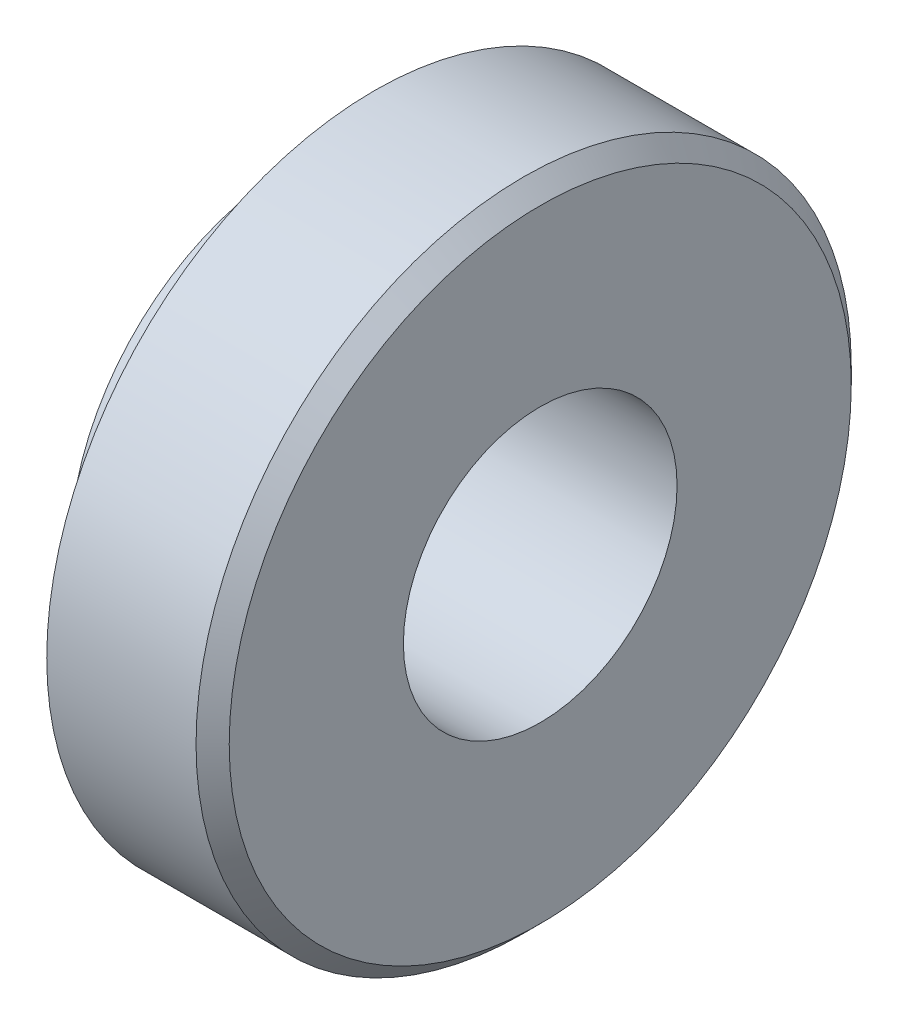
ISO-10303-21;
HEADER;
FILE_DESCRIPTION(('STEP AP214'),'2;1');
FILE_NAME('part.step','',(''),(''),'','','');
FILE_SCHEMA(('AUTOMOTIVE_DESIGN { 1 0 10303 214 1 1 1 1 }'));
ENDSEC;
DATA;
#1=APPLICATION_CONTEXT('core data for automotive mechanical design processes');
#2=APPLICATION_PROTOCOL_DEFINITION('international standard','automotive_design',2000,#1);
#3=PRODUCT_CONTEXT('',#1,'mechanical');
#4=PRODUCT('Part','Part','',(#3));
#5=PRODUCT_RELATED_PRODUCT_CATEGORY('part','',(#4));
#6=PRODUCT_DEFINITION_FORMATION('','',#4);
#7=PRODUCT_DEFINITION_CONTEXT('part definition',#1,'design');
#8=PRODUCT_DEFINITION('design','',#6,#7);
#9=PRODUCT_DEFINITION_SHAPE('','',#8);
#10=(LENGTH_UNIT() NAMED_UNIT(*) SI_UNIT(.MILLI.,.METRE.));
#11=(NAMED_UNIT(*) PLANE_ANGLE_UNIT() SI_UNIT($,.RADIAN.));
#12=(NAMED_UNIT(*) SI_UNIT($,.STERADIAN.) SOLID_ANGLE_UNIT());
#13=UNCERTAINTY_MEASURE_WITH_UNIT(LENGTH_MEASURE(1.E-05),#10,'distance_accuracy_value','');
#14=(GEOMETRIC_REPRESENTATION_CONTEXT(3) GLOBAL_UNCERTAINTY_ASSIGNED_CONTEXT((#13)) GLOBAL_UNIT_ASSIGNED_CONTEXT((#10,
#11,#12)) REPRESENTATION_CONTEXT('',''));
#15=CARTESIAN_POINT('',(0.,0.,0.));
#16=DIRECTION('',(0.,0.,1.));
#17=DIRECTION('',(1.,0.,0.));
#18=AXIS2_PLACEMENT_3D('',#15,#16,#17);
#19=CARTESIAN_POINT('',(0.,3.95,0.));
#20=DIRECTION('',(-1.,0.,0.));
#21=DIRECTION('',(0.,0.,1.));
#22=AXIS2_PLACEMENT_3D('',#19,#20,#21);
#23=PLANE('',#22);
#24=CARTESIAN_POINT('',(0.,0.,0.));
#25=DIRECTION('',(-1.,0.,0.));
#26=DIRECTION('',(0.,0.,1.));
#27=AXIS2_PLACEMENT_3D('',#24,#25,#26);
#28=CIRCLE('',#27,3.75);
#29=CARTESIAN_POINT('',(0.,0.,3.75));
#30=VERTEX_POINT('',#29);
#31=EDGE_CURVE('E10',#30,#30,#28,.F.);
#32=ORIENTED_EDGE('',*,*,#31,.T.);
#33=EDGE_LOOP('',(#32));
#34=FACE_BOUND('',#33,.T.);
#35=CARTESIAN_POINT('',(0.,0.,0.));
#36=DIRECTION('',(-1.,0.,0.));
#37=DIRECTION('',(0.,0.,1.));
#38=AXIS2_PLACEMENT_3D('',#35,#36,#37);
#39=CIRCLE('',#38,1.65);
#40=CARTESIAN_POINT('',(0.,0.,1.65));
#41=VERTEX_POINT('',#40);
#42=EDGE_CURVE('E47',#41,#41,#39,.T.);
#43=ORIENTED_EDGE('',*,*,#42,.T.);
#44=EDGE_LOOP('',(#43));
#45=FACE_BOUND('',#44,.T.);
#46=ADVANCED_FACE('F25',(#34,#45),#23,.F.);
#47=CARTESIAN_POINT('',(0.,0.,0.));
#48=DIRECTION('',(-1.,0.,0.));
#49=DIRECTION('',(0.,0.,1.));
#50=AXIS2_PLACEMENT_3D('',#47,#48,#49);
#51=CYLINDRICAL_SURFACE('',#50,3.95);
#52=CARTESIAN_POINT('',(-0.199999999999998,0.,0.));
#53=DIRECTION('',(-1.,0.,0.));
#54=DIRECTION('',(0.,0.,1.));
#55=AXIS2_PLACEMENT_3D('',#52,#53,#54);
#56=CIRCLE('',#55,3.95);
#57=CARTESIAN_POINT('',(-0.199999999999998,0.,3.95));
#58=VERTEX_POINT('',#57);
#59=EDGE_CURVE('E31',#58,#58,#56,.T.);
#60=ORIENTED_EDGE('',*,*,#59,.T.);
#61=EDGE_LOOP('',(#60));
#62=FACE_BOUND('',#61,.T.);
#63=CARTESIAN_POINT('',(-2.,0.,0.));
#64=DIRECTION('',(-1.,0.,0.));
#65=DIRECTION('',(0.,0.,1.));
#66=AXIS2_PLACEMENT_3D('',#63,#64,#65);
#67=CIRCLE('',#66,3.95);
#68=CARTESIAN_POINT('',(-2.,0.,3.95));
#69=VERTEX_POINT('',#68);
#70=EDGE_CURVE('E35',#69,#69,#67,.T.);
#71=ORIENTED_EDGE('',*,*,#70,.F.);
#72=EDGE_LOOP('',(#71));
#73=FACE_BOUND('',#72,.T.);
#74=ADVANCED_FACE('F71',(#62,#73),#51,.T.);
#75=CARTESIAN_POINT('',(-2.,2.69,0.));
#76=DIRECTION('',(1.,0.,0.));
#77=DIRECTION('',(0.,0.,-1.));
#78=AXIS2_PLACEMENT_3D('',#75,#76,#77);
#79=PLANE('',#78);
#80=CARTESIAN_POINT('',(-2.,0.,0.));
#81=DIRECTION('',(-1.,0.,0.));
#82=DIRECTION('',(0.,0.,1.));
#83=AXIS2_PLACEMENT_3D('',#80,#81,#82);
#84=CIRCLE('',#83,2.69);
#85=CARTESIAN_POINT('',(-2.,0.,2.69));
#86=VERTEX_POINT('',#85);
#87=EDGE_CURVE('E39',#86,#86,#84,.T.);
#88=ORIENTED_EDGE('',*,*,#87,.F.);
#89=EDGE_LOOP('',(#88));
#90=FACE_BOUND('',#89,.T.);
#91=ORIENTED_EDGE('',*,*,#70,.T.);
#92=EDGE_LOOP('',(#91));
#93=FACE_BOUND('',#92,.T.);
#94=ADVANCED_FACE('F65',(#90,#93),#79,.F.);
#95=CARTESIAN_POINT('',(0.,0.,0.));
#96=DIRECTION('',(-1.,0.,0.));
#97=DIRECTION('',(0.,0.,1.));
#98=AXIS2_PLACEMENT_3D('',#95,#96,#97);
#99=CYLINDRICAL_SURFACE('',#98,2.69);
#100=CARTESIAN_POINT('',(-2.98,0.,0.));
#101=DIRECTION('',(-1.,0.,0.));
#102=DIRECTION('',(0.,0.,1.));
#103=AXIS2_PLACEMENT_3D('',#100,#101,#102);
#104=CIRCLE('',#103,2.69);
#105=CARTESIAN_POINT('',(-2.98,0.,2.69));
#106=VERTEX_POINT('',#105);
#107=EDGE_CURVE('E44',#106,#106,#104,.T.);
#108=ORIENTED_EDGE('',*,*,#107,.F.);
#109=EDGE_LOOP('',(#108));
#110=FACE_BOUND('',#109,.T.);
#111=ORIENTED_EDGE('',*,*,#87,.T.);
#112=EDGE_LOOP('',(#111));
#113=FACE_BOUND('',#112,.T.);
#114=ADVANCED_FACE('F59',(#110,#113),#99,.T.);
#115=CARTESIAN_POINT('',(-2.98,0.,0.));
#116=DIRECTION('',(1.,0.,0.));
#117=DIRECTION('',(0.,0.,-1.));
#118=AXIS2_PLACEMENT_3D('',#115,#116,#117);
#119=PLANE('',#118);
#120=CARTESIAN_POINT('',(-2.98,0.,0.));
#121=DIRECTION('',(-1.,0.,0.));
#122=DIRECTION('',(0.,0.,1.));
#123=AXIS2_PLACEMENT_3D('',#120,#121,#122);
#124=CIRCLE('',#123,1.64999999999999);
#125=CARTESIAN_POINT('',(-2.98,0.,1.64999999999999));
#126=VERTEX_POINT('',#125);
#127=EDGE_CURVE('E50',#126,#126,#124,.T.);
#128=ORIENTED_EDGE('',*,*,#127,.F.);
#129=EDGE_LOOP('',(#128));
#130=FACE_BOUND('',#129,.T.);
#131=ORIENTED_EDGE('',*,*,#107,.T.);
#132=EDGE_LOOP('',(#131));
#133=FACE_BOUND('',#132,.T.);
#134=ADVANCED_FACE('F56',(#130,#133),#119,.F.);
#135=CARTESIAN_POINT('',(-2.98,0.,0.));
#136=DIRECTION('',(-1.,0.,0.));
#137=DIRECTION('',(0.,0.,1.));
#138=AXIS2_PLACEMENT_3D('',#135,#136,#137);
#139=CYLINDRICAL_SURFACE('',#138,1.64999999999999);
#140=ORIENTED_EDGE('',*,*,#42,.F.);
#141=EDGE_LOOP('',(#140));
#142=FACE_BOUND('',#141,.T.);
#143=ORIENTED_EDGE('',*,*,#127,.T.);
#144=EDGE_LOOP('',(#143));
#145=FACE_BOUND('',#144,.T.);
#146=ADVANCED_FACE('F54',(#142,#145),#139,.F.);
#147=CARTESIAN_POINT('',(-0.199999999999998,0.,0.));
#148=DIRECTION('',(-1.,0.,0.));
#149=DIRECTION('',(0.,0.,1.));
#150=AXIS2_PLACEMENT_3D('',#147,#148,#149);
#151=CONICAL_SURFACE('',#150,3.95,0.785398163397453);
#152=ORIENTED_EDGE('',*,*,#31,.F.);
#153=EDGE_LOOP('',(#152));
#154=FACE_BOUND('',#153,.T.);
#155=ORIENTED_EDGE('',*,*,#59,.F.);
#156=EDGE_LOOP('',(#155));
#157=FACE_BOUND('',#156,.T.);
#158=ADVANCED_FACE('F83',(#154,#157),#151,.T.);
#159=CLOSED_SHELL('',(#46,#74,#94,#114,#134,#146,#158));
#160=MANIFOLD_SOLID_BREP('B2',#159);
#161=ADVANCED_BREP_SHAPE_REPRESENTATION('',(#18,#160),#14);
#162=SHAPE_DEFINITION_REPRESENTATION(#9,#161);
ENDSEC;
END-ISO-10303-21;
